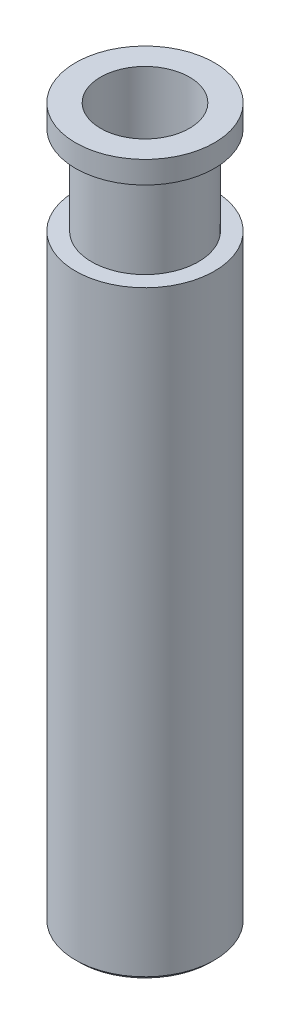
ISO-10303-21;
HEADER;
FILE_DESCRIPTION(('STEP AP214'),'2;1');
FILE_NAME('part.step','',(''),(''),'','','');
FILE_SCHEMA(('AUTOMOTIVE_DESIGN { 1 0 10303 214 1 1 1 1 }'));
ENDSEC;
DATA;
#1=APPLICATION_CONTEXT('core data for automotive mechanical design processes');
#2=APPLICATION_PROTOCOL_DEFINITION('international standard','automotive_design',2000,#1);
#3=PRODUCT_CONTEXT('',#1,'mechanical');
#4=PRODUCT('Part','Part','',(#3));
#5=PRODUCT_RELATED_PRODUCT_CATEGORY('part','',(#4));
#6=PRODUCT_DEFINITION_FORMATION('','',#4);
#7=PRODUCT_DEFINITION_CONTEXT('part definition',#1,'design');
#8=PRODUCT_DEFINITION('design','',#6,#7);
#9=PRODUCT_DEFINITION_SHAPE('','',#8);
#10=(LENGTH_UNIT() NAMED_UNIT(*) SI_UNIT(.MILLI.,.METRE.));
#11=(NAMED_UNIT(*) PLANE_ANGLE_UNIT() SI_UNIT($,.RADIAN.));
#12=(NAMED_UNIT(*) SI_UNIT($,.STERADIAN.) SOLID_ANGLE_UNIT());
#13=UNCERTAINTY_MEASURE_WITH_UNIT(LENGTH_MEASURE(1.E-05),#10,'distance_accuracy_value','');
#14=(GEOMETRIC_REPRESENTATION_CONTEXT(3) GLOBAL_UNCERTAINTY_ASSIGNED_CONTEXT((#13)) GLOBAL_UNIT_ASSIGNED_CONTEXT((#10,
#11,#12)) REPRESENTATION_CONTEXT('',''));
#15=CARTESIAN_POINT('',(0.,0.,0.));
#16=DIRECTION('',(0.,0.,1.));
#17=DIRECTION('',(1.,0.,0.));
#18=AXIS2_PLACEMENT_3D('',#15,#16,#17);
#19=CARTESIAN_POINT('',(0.,-1.5875,0.));
#20=DIRECTION('',(0.,1.,0.));
#21=DIRECTION('',(0.,0.,1.));
#22=AXIS2_PLACEMENT_3D('',#19,#20,#21);
#23=CYLINDRICAL_SURFACE('',#22,4.95935);
#24=CARTESIAN_POINT('',(0.,-1.5875,0.));
#25=DIRECTION('',(0.,1.,0.));
#26=DIRECTION('',(0.,0.,1.));
#27=AXIS2_PLACEMENT_3D('',#24,#25,#26);
#28=CIRCLE('',#27,4.95935);
#29=CARTESIAN_POINT('',(0.,-1.5875,4.95935));
#30=VERTEX_POINT('',#29);
#31=EDGE_CURVE('E46',#30,#30,#28,.T.);
#32=ORIENTED_EDGE('',*,*,#31,.T.);
#33=EDGE_LOOP('',(#32));
#34=FACE_BOUND('',#33,.T.);
#35=CARTESIAN_POINT('',(0.,0.,0.));
#36=DIRECTION('',(0.,1.,0.));
#37=DIRECTION('',(0.,0.,1.));
#38=AXIS2_PLACEMENT_3D('',#35,#36,#37);
#39=CIRCLE('',#38,4.95935);
#40=CARTESIAN_POINT('',(0.,0.,4.95935));
#41=VERTEX_POINT('',#40);
#42=EDGE_CURVE('E49',#41,#41,#39,.T.);
#43=ORIENTED_EDGE('',*,*,#42,.F.);
#44=EDGE_LOOP('',(#43));
#45=FACE_BOUND('',#44,.T.);
#46=ADVANCED_FACE('F31',(#34,#45),#23,.T.);
#47=CARTESIAN_POINT('',(0.,-1.5875,0.));
#48=DIRECTION('',(0.,1.,0.));
#49=DIRECTION('',(0.,0.,1.));
#50=AXIS2_PLACEMENT_3D('',#47,#48,#49);
#51=PLANE('',#50);
#52=CARTESIAN_POINT('',(0.,-1.5875,0.));
#53=DIRECTION('',(0.,-1.,0.));
#54=DIRECTION('',(0.,0.,-1.));
#55=AXIS2_PLACEMENT_3D('',#52,#53,#54);
#56=CIRCLE('',#55,3.81);
#57=CARTESIAN_POINT('',(0.,-1.5875,-3.81));
#58=VERTEX_POINT('',#57);
#59=EDGE_CURVE('E42',#58,#58,#56,.T.);
#60=ORIENTED_EDGE('',*,*,#59,.F.);
#61=EDGE_LOOP('',(#60));
#62=FACE_BOUND('',#61,.T.);
#63=ORIENTED_EDGE('',*,*,#31,.F.);
#64=EDGE_LOOP('',(#63));
#65=FACE_BOUND('',#64,.T.);
#66=ADVANCED_FACE('F79',(#62,#65),#51,.F.);
#67=CARTESIAN_POINT('',(0.,0.,0.));
#68=DIRECTION('',(0.,1.,0.));
#69=DIRECTION('',(0.,0.,1.));
#70=AXIS2_PLACEMENT_3D('',#67,#68,#69);
#71=PLANE('',#70);
#72=CARTESIAN_POINT('',(0.,0.,0.));
#73=DIRECTION('',(0.,1.,0.));
#74=DIRECTION('',(0.,0.,1.));
#75=AXIS2_PLACEMENT_3D('',#72,#73,#74);
#76=CIRCLE('',#75,3.175);
#77=CARTESIAN_POINT('',(0.,0.,3.175));
#78=VERTEX_POINT('',#77);
#79=EDGE_CURVE('E61',#78,#78,#76,.T.);
#80=ORIENTED_EDGE('',*,*,#79,.F.);
#81=EDGE_LOOP('',(#80));
#82=FACE_BOUND('',#81,.T.);
#83=ORIENTED_EDGE('',*,*,#42,.T.);
#84=EDGE_LOOP('',(#83));
#85=FACE_BOUND('',#84,.T.);
#86=ADVANCED_FACE('F75',(#82,#85),#71,.T.);
#87=CARTESIAN_POINT('',(0.,-7.9375,0.));
#88=DIRECTION('',(0.,1.,0.));
#89=DIRECTION('',(0.,0.,1.));
#90=AXIS2_PLACEMENT_3D('',#87,#88,#89);
#91=CYLINDRICAL_SURFACE('',#90,3.81);
#92=CARTESIAN_POINT('',(0.,-7.9375,0.));
#93=DIRECTION('',(0.,-1.,0.));
#94=DIRECTION('',(0.,0.,-1.));
#95=AXIS2_PLACEMENT_3D('',#92,#93,#94);
#96=CIRCLE('',#95,3.81);
#97=CARTESIAN_POINT('',(0.,-7.9375,-3.81));
#98=VERTEX_POINT('',#97);
#99=EDGE_CURVE('E52',#98,#98,#96,.T.);
#100=ORIENTED_EDGE('',*,*,#99,.F.);
#101=EDGE_LOOP('',(#100));
#102=FACE_BOUND('',#101,.T.);
#103=ORIENTED_EDGE('',*,*,#59,.T.);
#104=EDGE_LOOP('',(#103));
#105=FACE_BOUND('',#104,.T.);
#106=ADVANCED_FACE('F78',(#102,#105),#91,.T.);
#107=CARTESIAN_POINT('',(0.,-50.8,0.));
#108=DIRECTION('',(0.,1.,0.));
#109=DIRECTION('',(0.,0.,1.));
#110=AXIS2_PLACEMENT_3D('',#107,#108,#109);
#111=CYLINDRICAL_SURFACE('',#110,4.95935);
#112=CARTESIAN_POINT('',(0.,-50.546,0.));
#113=DIRECTION('',(0.,-1.,0.));
#114=DIRECTION('',(0.,0.,-1.));
#115=AXIS2_PLACEMENT_3D('',#112,#113,#114);
#116=CIRCLE('',#115,4.95935);
#117=CARTESIAN_POINT('',(0.,-50.546,-4.95935));
#118=VERTEX_POINT('',#117);
#119=EDGE_CURVE('E10',#118,#118,#116,.F.);
#120=ORIENTED_EDGE('',*,*,#119,.T.);
#121=EDGE_LOOP('',(#120));
#122=FACE_BOUND('',#121,.T.);
#123=CARTESIAN_POINT('',(0.,-7.9375,0.));
#124=DIRECTION('',(0.,-1.,0.));
#125=DIRECTION('',(0.,0.,-1.));
#126=AXIS2_PLACEMENT_3D('',#123,#124,#125);
#127=CIRCLE('',#126,4.95935);
#128=CARTESIAN_POINT('',(0.,-7.9375,-4.95935));
#129=VERTEX_POINT('',#128);
#130=EDGE_CURVE('E57',#129,#129,#127,.T.);
#131=ORIENTED_EDGE('',*,*,#130,.T.);
#132=EDGE_LOOP('',(#131));
#133=FACE_BOUND('',#132,.T.);
#134=ADVANCED_FACE('F93',(#122,#133),#111,.T.);
#135=CARTESIAN_POINT('',(0.,-50.8,0.));
#136=DIRECTION('',(0.,-1.,0.));
#137=DIRECTION('',(0.,0.,-1.));
#138=AXIS2_PLACEMENT_3D('',#135,#136,#137);
#139=PLANE('',#138);
#140=CARTESIAN_POINT('',(0.,-50.8,0.));
#141=DIRECTION('',(0.,-1.,0.));
#142=DIRECTION('',(0.,0.,-1.));
#143=AXIS2_PLACEMENT_3D('',#140,#141,#142);
#144=CIRCLE('',#143,4.70535);
#145=CARTESIAN_POINT('',(0.,-50.8,-4.70535));
#146=VERTEX_POINT('',#145);
#147=EDGE_CURVE('E38',#146,#146,#144,.T.);
#148=ORIENTED_EDGE('',*,*,#147,.T.);
#149=EDGE_LOOP('',(#148));
#150=FACE_BOUND('',#149,.T.);
#151=ADVANCED_FACE('F97',(#150),#139,.T.);
#152=CARTESIAN_POINT('',(0.,-7.9375,0.));
#153=DIRECTION('',(0.,-1.,0.));
#154=DIRECTION('',(0.,0.,-1.));
#155=AXIS2_PLACEMENT_3D('',#152,#153,#154);
#156=PLANE('',#155);
#157=ORIENTED_EDGE('',*,*,#99,.T.);
#158=EDGE_LOOP('',(#157));
#159=FACE_BOUND('',#158,.T.);
#160=ORIENTED_EDGE('',*,*,#130,.F.);
#161=EDGE_LOOP('',(#160));
#162=FACE_BOUND('',#161,.T.);
#163=ADVANCED_FACE('F98',(#159,#162),#156,.F.);
#164=CARTESIAN_POINT('',(0.,-50.8,0.));
#165=DIRECTION('',(0.,1.,0.));
#166=DIRECTION('',(0.,0.,1.));
#167=AXIS2_PLACEMENT_3D('',#164,#165,#166);
#168=CONICAL_SURFACE('',#167,4.70535,0.785398163397447);
#169=ORIENTED_EDGE('',*,*,#119,.F.);
#170=EDGE_LOOP('',(#169));
#171=FACE_BOUND('',#170,.T.);
#172=ORIENTED_EDGE('',*,*,#147,.F.);
#173=EDGE_LOOP('',(#172));
#174=FACE_BOUND('',#173,.T.);
#175=ADVANCED_FACE('F33',(#171,#174),#168,.T.);
#176=CARTESIAN_POINT('',(0.,-7.9375,0.));
#177=DIRECTION('',(0.,1.,0.));
#178=DIRECTION('',(0.,0.,1.));
#179=AXIS2_PLACEMENT_3D('',#176,#177,#178);
#180=CYLINDRICAL_SURFACE('',#179,3.175);
#181=CARTESIAN_POINT('',(0.,-7.9375,0.));
#182=DIRECTION('',(0.,1.,0.));
#183=DIRECTION('',(0.,0.,1.));
#184=AXIS2_PLACEMENT_3D('',#181,#182,#183);
#185=CIRCLE('',#184,3.175);
#186=CARTESIAN_POINT('',(0.,-7.9375,3.175));
#187=VERTEX_POINT('',#186);
#188=EDGE_CURVE('E60',#187,#187,#185,.T.);
#189=ORIENTED_EDGE('',*,*,#188,.F.);
#190=EDGE_LOOP('',(#189));
#191=FACE_BOUND('',#190,.T.);
#192=ORIENTED_EDGE('',*,*,#79,.T.);
#193=EDGE_LOOP('',(#192));
#194=FACE_BOUND('',#193,.T.);
#195=ADVANCED_FACE('F69',(#191,#194),#180,.F.);
#196=CARTESIAN_POINT('',(0.,-7.9375,0.));
#197=DIRECTION('',(0.,1.,0.));
#198=DIRECTION('',(0.,0.,1.));
#199=AXIS2_PLACEMENT_3D('',#196,#197,#198);
#200=PLANE('',#199);
#201=ORIENTED_EDGE('',*,*,#188,.T.);
#202=EDGE_LOOP('',(#201));
#203=FACE_BOUND('',#202,.T.);
#204=ADVANCED_FACE('F67',(#203),#200,.T.);
#205=CLOSED_SHELL('',(#46,#66,#86,#106,#134,#151,#163,#175,#195,#204));
#206=MANIFOLD_SOLID_BREP('B2',#205);
#207=ADVANCED_BREP_SHAPE_REPRESENTATION('',(#18,#206),#14);
#208=SHAPE_DEFINITION_REPRESENTATION(#9,#207);
ENDSEC;
END-ISO-10303-21;
